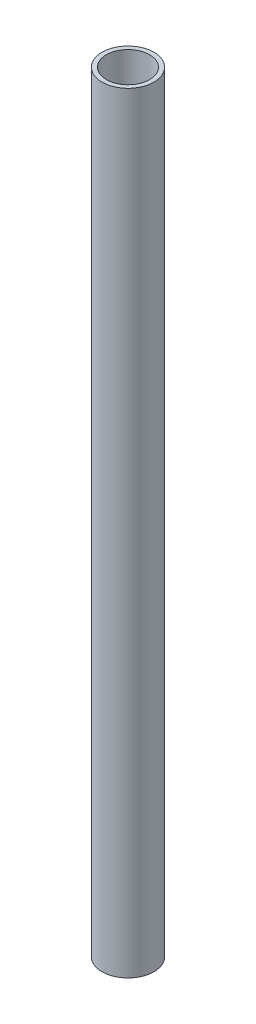
ISO-10303-21;
HEADER;
FILE_DESCRIPTION(('STEP AP214'),'2;1');
FILE_NAME('part.step','',(''),(''),'','','');
FILE_SCHEMA(('AUTOMOTIVE_DESIGN { 1 0 10303 214 1 1 1 1 }'));
ENDSEC;
DATA;
#1=APPLICATION_CONTEXT('core data for automotive mechanical design processes');
#2=APPLICATION_PROTOCOL_DEFINITION('international standard','automotive_design',2000,#1);
#3=PRODUCT_CONTEXT('',#1,'mechanical');
#4=PRODUCT('Part','Part','',(#3));
#5=PRODUCT_RELATED_PRODUCT_CATEGORY('part','',(#4));
#6=PRODUCT_DEFINITION_FORMATION('','',#4);
#7=PRODUCT_DEFINITION_CONTEXT('part definition',#1,'design');
#8=PRODUCT_DEFINITION('design','',#6,#7);
#9=PRODUCT_DEFINITION_SHAPE('','',#8);
#10=(LENGTH_UNIT() NAMED_UNIT(*) SI_UNIT(.MILLI.,.METRE.));
#11=(NAMED_UNIT(*) PLANE_ANGLE_UNIT() SI_UNIT($,.RADIAN.));
#12=(NAMED_UNIT(*) SI_UNIT($,.STERADIAN.) SOLID_ANGLE_UNIT());
#13=UNCERTAINTY_MEASURE_WITH_UNIT(LENGTH_MEASURE(1.E-05),#10,'distance_accuracy_value','');
#14=(GEOMETRIC_REPRESENTATION_CONTEXT(3) GLOBAL_UNCERTAINTY_ASSIGNED_CONTEXT((#13)) GLOBAL_UNIT_ASSIGNED_CONTEXT((#10,
#11,#12)) REPRESENTATION_CONTEXT('',''));
#15=CARTESIAN_POINT('',(0.,0.,0.));
#16=DIRECTION('',(0.,0.,1.));
#17=DIRECTION('',(1.,0.,0.));
#18=AXIS2_PLACEMENT_3D('',#15,#16,#17);
#19=CARTESIAN_POINT('',(0.,89.19,0.));
#20=DIRECTION('',(0.,1.,0.));
#21=DIRECTION('',(0.,0.,1.));
#22=AXIS2_PLACEMENT_3D('',#19,#20,#21);
#23=PLANE('',#22);
#24=CARTESIAN_POINT('',(0.,89.19,0.));
#25=DIRECTION('',(0.,1.,0.));
#26=DIRECTION('',(0.,0.,1.));
#27=AXIS2_PLACEMENT_3D('',#24,#25,#26);
#28=CIRCLE('',#27,3.);
#29=CARTESIAN_POINT('',(0.,89.19,3.));
#30=VERTEX_POINT('',#29);
#31=EDGE_CURVE('E10',#30,#30,#28,.T.);
#32=ORIENTED_EDGE('',*,*,#31,.T.);
#33=EDGE_LOOP('',(#32));
#34=FACE_BOUND('',#33,.T.);
#35=CARTESIAN_POINT('',(0.,89.19,0.));
#36=DIRECTION('',(0.,1.,0.));
#37=DIRECTION('',(0.,0.,1.));
#38=AXIS2_PLACEMENT_3D('',#35,#36,#37);
#39=CIRCLE('',#38,2.5);
#40=CARTESIAN_POINT('',(0.,89.19,2.5));
#41=VERTEX_POINT('',#40);
#42=EDGE_CURVE('E44',#41,#41,#39,.T.);
#43=ORIENTED_EDGE('',*,*,#42,.F.);
#44=EDGE_LOOP('',(#43));
#45=FACE_BOUND('',#44,.T.);
#46=ADVANCED_FACE('F33',(#34,#45),#23,.T.);
#47=CARTESIAN_POINT('',(0.,0.,0.));
#48=DIRECTION('',(0.,1.,0.));
#49=DIRECTION('',(0.,0.,1.));
#50=AXIS2_PLACEMENT_3D('',#47,#48,#49);
#51=PLANE('',#50);
#52=CARTESIAN_POINT('',(0.,0.,0.));
#53=DIRECTION('',(0.,1.,0.));
#54=DIRECTION('',(0.,0.,1.));
#55=AXIS2_PLACEMENT_3D('',#52,#53,#54);
#56=CIRCLE('',#55,3.);
#57=CARTESIAN_POINT('',(0.,0.,3.));
#58=VERTEX_POINT('',#57);
#59=EDGE_CURVE('E37',#58,#58,#56,.T.);
#60=ORIENTED_EDGE('',*,*,#59,.F.);
#61=EDGE_LOOP('',(#60));
#62=FACE_BOUND('',#61,.T.);
#63=CARTESIAN_POINT('',(0.,0.,0.));
#64=DIRECTION('',(0.,1.,0.));
#65=DIRECTION('',(0.,0.,1.));
#66=AXIS2_PLACEMENT_3D('',#63,#64,#65);
#67=CIRCLE('',#66,2.5);
#68=CARTESIAN_POINT('',(0.,0.,2.5));
#69=VERTEX_POINT('',#68);
#70=EDGE_CURVE('E46',#69,#69,#67,.T.);
#71=ORIENTED_EDGE('',*,*,#70,.T.);
#72=EDGE_LOOP('',(#71));
#73=FACE_BOUND('',#72,.T.);
#74=ADVANCED_FACE('F56',(#62,#73),#51,.F.);
#75=CARTESIAN_POINT('',(0.,89.19,0.));
#76=DIRECTION('',(0.,-1.,0.));
#77=DIRECTION('',(0.,0.,-1.));
#78=AXIS2_PLACEMENT_3D('',#75,#76,#77);
#79=CYLINDRICAL_SURFACE('',#78,3.);
#80=ORIENTED_EDGE('',*,*,#31,.F.);
#81=EDGE_LOOP('',(#80));
#82=FACE_BOUND('',#81,.T.);
#83=ORIENTED_EDGE('',*,*,#59,.T.);
#84=EDGE_LOOP('',(#83));
#85=FACE_BOUND('',#84,.T.);
#86=ADVANCED_FACE('F35',(#82,#85),#79,.T.);
#87=CARTESIAN_POINT('',(0.,89.19,0.));
#88=DIRECTION('',(0.,-1.,0.));
#89=DIRECTION('',(0.,0.,-1.));
#90=AXIS2_PLACEMENT_3D('',#87,#88,#89);
#91=CYLINDRICAL_SURFACE('',#90,2.5);
#92=ORIENTED_EDGE('',*,*,#42,.T.);
#93=EDGE_LOOP('',(#92));
#94=FACE_BOUND('',#93,.T.);
#95=ORIENTED_EDGE('',*,*,#70,.F.);
#96=EDGE_LOOP('',(#95));
#97=FACE_BOUND('',#96,.T.);
#98=ADVANCED_FACE('F52',(#94,#97),#91,.F.);
#99=CLOSED_SHELL('',(#46,#74,#86,#98));
#100=MANIFOLD_SOLID_BREP('B2',#99);
#101=ADVANCED_BREP_SHAPE_REPRESENTATION('',(#18,#100),#14);
#102=SHAPE_DEFINITION_REPRESENTATION(#9,#101);
ENDSEC;
END-ISO-10303-21;
